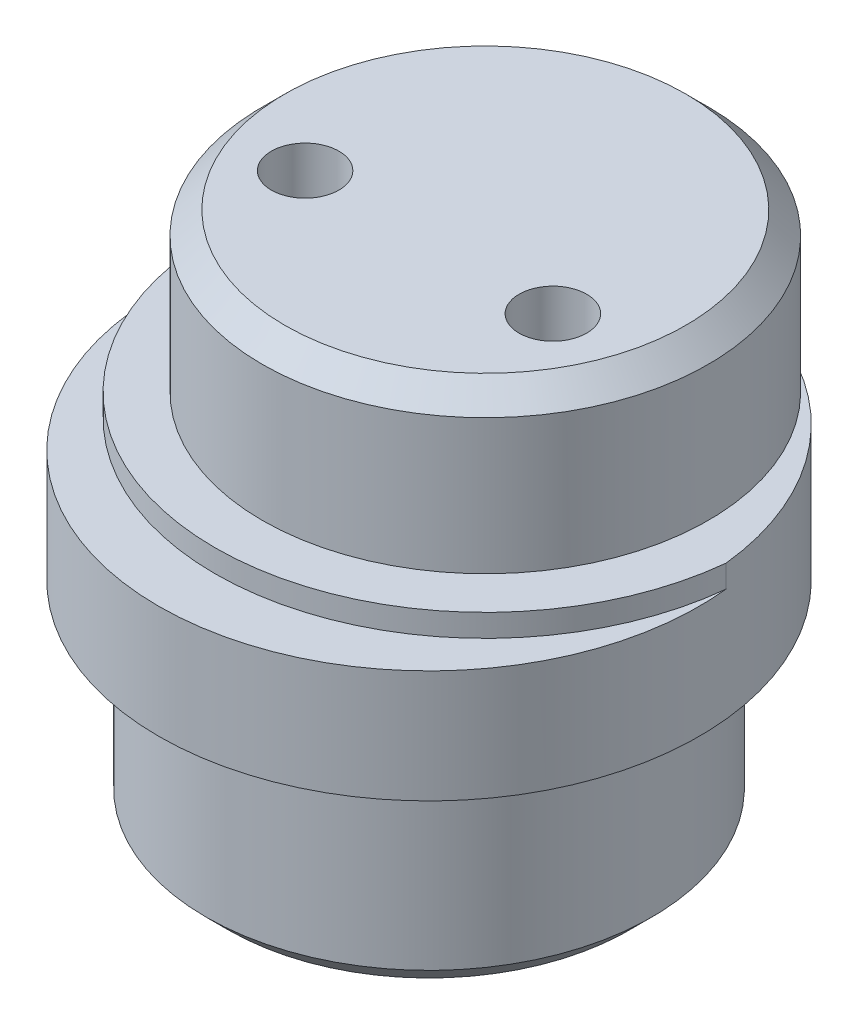
ISO-10303-21;
HEADER;
FILE_DESCRIPTION(('STEP AP214'),'2;1');
FILE_NAME('part.step','',(''),(''),'','','');
FILE_SCHEMA(('AUTOMOTIVE_DESIGN { 1 0 10303 214 1 1 1 1 }'));
ENDSEC;
DATA;
#1=APPLICATION_CONTEXT('core data for automotive mechanical design processes');
#2=APPLICATION_PROTOCOL_DEFINITION('international standard','automotive_design',2000,#1);
#3=PRODUCT_CONTEXT('',#1,'mechanical');
#4=PRODUCT('Part','Part','',(#3));
#5=PRODUCT_RELATED_PRODUCT_CATEGORY('part','',(#4));
#6=PRODUCT_DEFINITION_FORMATION('','',#4);
#7=PRODUCT_DEFINITION_CONTEXT('part definition',#1,'design');
#8=PRODUCT_DEFINITION('design','',#6,#7);
#9=PRODUCT_DEFINITION_SHAPE('','',#8);
#10=(LENGTH_UNIT() NAMED_UNIT(*) SI_UNIT(.MILLI.,.METRE.));
#11=(NAMED_UNIT(*) PLANE_ANGLE_UNIT() SI_UNIT($,.RADIAN.));
#12=(NAMED_UNIT(*) SI_UNIT($,.STERADIAN.) SOLID_ANGLE_UNIT());
#13=UNCERTAINTY_MEASURE_WITH_UNIT(LENGTH_MEASURE(1.E-05),#10,'distance_accuracy_value','');
#14=(GEOMETRIC_REPRESENTATION_CONTEXT(3) GLOBAL_UNCERTAINTY_ASSIGNED_CONTEXT((#13)) GLOBAL_UNIT_ASSIGNED_CONTEXT((#10,
#11,#12)) REPRESENTATION_CONTEXT('',''));
#15=CARTESIAN_POINT('',(0.,0.,0.));
#16=DIRECTION('',(0.,0.,1.));
#17=DIRECTION('',(1.,0.,0.));
#18=AXIS2_PLACEMENT_3D('',#15,#16,#17);
#19=CARTESIAN_POINT('',(0.,15.,0.));
#20=DIRECTION('',(0.,-1.,0.));
#21=DIRECTION('',(0.,0.,-1.));
#22=AXIS2_PLACEMENT_3D('',#19,#20,#21);
#23=CYLINDRICAL_SURFACE('',#22,12.);
#24=CARTESIAN_POINT('',(0.,9.,0.));
#25=DIRECTION('',(0.,1.,0.));
#26=DIRECTION('',(0.,0.,1.));
#27=AXIS2_PLACEMENT_3D('',#24,#25,#26);
#28=CIRCLE('',#27,12.);
#29=CARTESIAN_POINT('',(0.,9.,12.));
#30=VERTEX_POINT('',#29);
#31=EDGE_CURVE('E106',#30,#30,#28,.T.);
#32=ORIENTED_EDGE('',*,*,#31,.T.);
#33=EDGE_LOOP('',(#32));
#34=FACE_BOUND('',#33,.T.);
#35=DIRECTION('',(0.,1.,0.));
#36=VECTOR('',#35,1.);
#37=CARTESIAN_POINT('',(11.93471826228,14.5,-1.25));
#38=LINE('',#37,#36);
#39=CARTESIAN_POINT('',(11.93471826228,14.,-1.25));
#40=VERTEX_POINT('',#39);
#41=CARTESIAN_POINT('',(11.93471826228,15.,-1.25));
#42=VERTEX_POINT('',#41);
#43=EDGE_CURVE('E60',#40,#42,#38,.T.);
#44=ORIENTED_EDGE('',*,*,#43,.F.);
#45=CARTESIAN_POINT('',(0.,14.,0.));
#46=DIRECTION('',(0.,1.,0.));
#47=DIRECTION('',(0.,0.,1.));
#48=AXIS2_PLACEMENT_3D('',#45,#46,#47);
#49=CIRCLE('',#48,12.);
#50=CARTESIAN_POINT('',(-11.93471826228,14.,-1.25));
#51=VERTEX_POINT('',#50);
#52=EDGE_CURVE('E82',#51,#40,#49,.T.);
#53=ORIENTED_EDGE('',*,*,#52,.F.);
#54=DIRECTION('',(0.,1.,0.));
#55=VECTOR('',#54,1.);
#56=CARTESIAN_POINT('',(-11.93471826228,14.5,-1.25));
#57=LINE('',#56,#55);
#58=CARTESIAN_POINT('',(-11.93471826228,15.,-1.25));
#59=VERTEX_POINT('',#58);
#60=EDGE_CURVE('E92',#59,#51,#57,.F.);
#61=ORIENTED_EDGE('',*,*,#60,.F.);
#62=CARTESIAN_POINT('',(0.,15.,0.));
#63=DIRECTION('',(0.,1.,0.));
#64=DIRECTION('',(0.,0.,1.));
#65=AXIS2_PLACEMENT_3D('',#62,#63,#64);
#66=CIRCLE('',#65,12.);
#67=CARTESIAN_POINT('',(-5.90248218972323,15.,-10.448));
#68=VERTEX_POINT('',#67);
#69=EDGE_CURVE('E116',#68,#59,#66,.T.);
#70=ORIENTED_EDGE('',*,*,#69,.F.);
#71=CARTESIAN_POINT('',(5.90248218972323,15.,-10.448));
#72=VERTEX_POINT('',#71);
#73=EDGE_CURVE('E111',#72,#68,#66,.T.);
#74=ORIENTED_EDGE('',*,*,#73,.F.);
#75=EDGE_CURVE('E98',#42,#72,#66,.T.);
#76=ORIENTED_EDGE('',*,*,#75,.F.);
#77=EDGE_LOOP('',(#44,#53,#61,#70,#74,#76));
#78=FACE_BOUND('',#77,.T.);
#79=ADVANCED_FACE('F43',(#34,#78),#23,.T.);
#80=CARTESIAN_POINT('',(0.,15.,0.));
#81=DIRECTION('',(0.,1.,0.));
#82=DIRECTION('',(0.,0.,1.));
#83=AXIS2_PLACEMENT_3D('',#80,#81,#82);
#84=PLANE('',#83);
#85=ORIENTED_EDGE('',*,*,#69,.T.);
#86=CARTESIAN_POINT('',(0.,15.,-2.5));
#87=DIRECTION('',(0.,1.,0.));
#88=DIRECTION('',(0.,0.,1.));
#89=AXIS2_PLACEMENT_3D('',#86,#87,#88);
#90=CIRCLE('',#89,12.);
#91=EDGE_CURVE('E89',#59,#42,#90,.T.);
#92=ORIENTED_EDGE('',*,*,#91,.T.);
#93=ORIENTED_EDGE('',*,*,#75,.T.);
#94=CARTESIAN_POINT('',(0.,15.,-2.5));
#95=DIRECTION('',(0.,1.,0.));
#96=DIRECTION('',(0.,0.,1.));
#97=AXIS2_PLACEMENT_3D('',#94,#95,#96);
#98=CIRCLE('',#97,9.9);
#99=EDGE_CURVE('E68',#68,#72,#98,.T.);
#100=ORIENTED_EDGE('',*,*,#99,.F.);
#101=EDGE_LOOP('',(#85,#92,#93,#100));
#102=FACE_BOUND('',#101,.T.);
#103=ADVANCED_FACE('F147',(#102),#84,.T.);
#104=CARTESIAN_POINT('',(0.,9.,0.));
#105=DIRECTION('',(0.,-1.,0.));
#106=DIRECTION('',(0.,0.,-1.));
#107=AXIS2_PLACEMENT_3D('',#104,#105,#106);
#108=CYLINDRICAL_SURFACE('',#107,9.9);
#109=CARTESIAN_POINT('',(0.,0.999999999999997,0.));
#110=DIRECTION('',(0.,1.,0.));
#111=DIRECTION('',(0.,0.,1.));
#112=AXIS2_PLACEMENT_3D('',#109,#110,#111);
#113=CIRCLE('',#112,9.9);
#114=CARTESIAN_POINT('',(0.,0.999999999999997,9.9));
#115=VERTEX_POINT('',#114);
#116=EDGE_CURVE('E88',#115,#115,#113,.T.);
#117=ORIENTED_EDGE('',*,*,#116,.T.);
#118=EDGE_LOOP('',(#117));
#119=FACE_BOUND('',#118,.T.);
#120=CARTESIAN_POINT('',(0.,9.,0.));
#121=DIRECTION('',(0.,1.,0.));
#122=DIRECTION('',(0.,0.,1.));
#123=AXIS2_PLACEMENT_3D('',#120,#121,#122);
#124=CIRCLE('',#123,9.9);
#125=CARTESIAN_POINT('',(0.,9.,9.9));
#126=VERTEX_POINT('',#125);
#127=EDGE_CURVE('E115',#126,#126,#124,.T.);
#128=ORIENTED_EDGE('',*,*,#127,.F.);
#129=EDGE_LOOP('',(#128));
#130=FACE_BOUND('',#129,.T.);
#131=ADVANCED_FACE('F153',(#119,#130),#108,.T.);
#132=CARTESIAN_POINT('',(0.,0.,0.));
#133=DIRECTION('',(0.,1.,0.));
#134=DIRECTION('',(0.,0.,1.));
#135=AXIS2_PLACEMENT_3D('',#132,#133,#134);
#136=PLANE('',#135);
#137=CARTESIAN_POINT('',(0.,0.,0.));
#138=DIRECTION('',(0.,1.,0.));
#139=DIRECTION('',(0.,0.,1.));
#140=AXIS2_PLACEMENT_3D('',#137,#138,#139);
#141=CIRCLE('',#140,8.9);
#142=CARTESIAN_POINT('',(0.,0.,8.9));
#143=VERTEX_POINT('',#142);
#144=EDGE_CURVE('E127',#143,#143,#141,.F.);
#145=ORIENTED_EDGE('',*,*,#144,.T.);
#146=EDGE_LOOP('',(#145));
#147=FACE_BOUND('',#146,.T.);
#148=CARTESIAN_POINT('',(0.,0.,-5.5));
#149=DIRECTION('',(0.,-1.,0.));
#150=DIRECTION('',(0.,0.,-1.));
#151=AXIS2_PLACEMENT_3D('',#148,#149,#150);
#152=CIRCLE('',#151,1.5);
#153=CARTESIAN_POINT('',(0.,0.,-7.));
#154=VERTEX_POINT('',#153);
#155=EDGE_CURVE('E227',#154,#154,#152,.T.);
#156=ORIENTED_EDGE('',*,*,#155,.F.);
#157=EDGE_LOOP('',(#156));
#158=FACE_BOUND('',#157,.T.);
#159=CARTESIAN_POINT('',(0.,0.,5.5));
#160=DIRECTION('',(0.,-1.,0.));
#161=DIRECTION('',(0.,0.,-1.));
#162=AXIS2_PLACEMENT_3D('',#159,#160,#161);
#163=CIRCLE('',#162,1.5);
#164=CARTESIAN_POINT('',(0.,0.,4.));
#165=VERTEX_POINT('',#164);
#166=EDGE_CURVE('E236',#165,#165,#163,.T.);
#167=ORIENTED_EDGE('',*,*,#166,.F.);
#168=EDGE_LOOP('',(#167));
#169=FACE_BOUND('',#168,.T.);
#170=CARTESIAN_POINT('',(5.5,0.,0.));
#171=DIRECTION('',(0.,1.,0.));
#172=DIRECTION('',(0.,0.,1.));
#173=AXIS2_PLACEMENT_3D('',#170,#171,#172);
#174=CIRCLE('',#173,1.5);
#175=CARTESIAN_POINT('',(5.5,0.,1.5));
#176=VERTEX_POINT('',#175);
#177=EDGE_CURVE('E94',#176,#176,#174,.T.);
#178=ORIENTED_EDGE('',*,*,#177,.T.);
#179=EDGE_LOOP('',(#178));
#180=FACE_BOUND('',#179,.T.);
#181=CARTESIAN_POINT('',(-5.5,0.,0.));
#182=DIRECTION('',(0.,1.,0.));
#183=DIRECTION('',(0.,0.,1.));
#184=AXIS2_PLACEMENT_3D('',#181,#182,#183);
#185=CIRCLE('',#184,1.5);
#186=CARTESIAN_POINT('',(-5.5,0.,1.5));
#187=VERTEX_POINT('',#186);
#188=EDGE_CURVE('E226',#187,#187,#185,.T.);
#189=ORIENTED_EDGE('',*,*,#188,.T.);
#190=EDGE_LOOP('',(#189));
#191=FACE_BOUND('',#190,.T.);
#192=ADVANCED_FACE('F158',(#147,#158,#169,#180,#191),#136,.F.);
#193=CARTESIAN_POINT('',(0.,9.,0.));
#194=DIRECTION('',(0.,1.,0.));
#195=DIRECTION('',(0.,0.,1.));
#196=AXIS2_PLACEMENT_3D('',#193,#194,#195);
#197=PLANE('',#196);
#198=ORIENTED_EDGE('',*,*,#127,.T.);
#199=EDGE_LOOP('',(#198));
#200=FACE_BOUND('',#199,.T.);
#201=ORIENTED_EDGE('',*,*,#31,.F.);
#202=EDGE_LOOP('',(#201));
#203=FACE_BOUND('',#202,.T.);
#204=ADVANCED_FACE('F157',(#200,#203),#197,.F.);
#205=CARTESIAN_POINT('',(0.,15.,-2.5));
#206=DIRECTION('',(0.,1.,0.));
#207=DIRECTION('',(0.,0.,1.));
#208=AXIS2_PLACEMENT_3D('',#205,#206,#207);
#209=PLANE('',#208);
#210=EDGE_CURVE('E100',#72,#68,#98,.T.);
#211=ORIENTED_EDGE('',*,*,#210,.F.);
#212=ORIENTED_EDGE('',*,*,#73,.T.);
#213=EDGE_LOOP('',(#211,#212));
#214=FACE_BOUND('',#213,.T.);
#215=ADVANCED_FACE('F177',(#214),#209,.F.);
#216=CARTESIAN_POINT('',(0.,22.,-2.5));
#217=DIRECTION('',(0.,-1.,0.));
#218=DIRECTION('',(0.,0.,-1.));
#219=AXIS2_PLACEMENT_3D('',#216,#217,#218);
#220=CYLINDRICAL_SURFACE('',#219,9.9);
#221=CARTESIAN_POINT('',(0.,21.,-2.5));
#222=DIRECTION('',(0.,1.,0.));
#223=DIRECTION('',(0.,0.,1.));
#224=AXIS2_PLACEMENT_3D('',#221,#222,#223);
#225=CIRCLE('',#224,9.9);
#226=CARTESIAN_POINT('',(0.,21.,7.4));
#227=VERTEX_POINT('',#226);
#228=EDGE_CURVE('E11',#227,#227,#225,.F.);
#229=ORIENTED_EDGE('',*,*,#228,.T.);
#230=EDGE_LOOP('',(#229));
#231=FACE_BOUND('',#230,.T.);
#232=ORIENTED_EDGE('',*,*,#210,.T.);
#233=ORIENTED_EDGE('',*,*,#99,.T.);
#234=EDGE_LOOP('',(#232,#233));
#235=FACE_BOUND('',#234,.T.);
#236=ADVANCED_FACE('F182',(#231,#235),#220,.T.);
#237=CARTESIAN_POINT('',(0.,22.,-2.5));
#238=DIRECTION('',(0.,1.,0.));
#239=DIRECTION('',(0.,0.,1.));
#240=AXIS2_PLACEMENT_3D('',#237,#238,#239);
#241=PLANE('',#240);
#242=CARTESIAN_POINT('',(0.,22.,-2.5));
#243=DIRECTION('',(0.,1.,0.));
#244=DIRECTION('',(0.,0.,1.));
#245=AXIS2_PLACEMENT_3D('',#242,#243,#244);
#246=CIRCLE('',#245,8.90000000000001);
#247=CARTESIAN_POINT('',(0.,22.,6.4));
#248=VERTEX_POINT('',#247);
#249=EDGE_CURVE('E53',#248,#248,#246,.T.);
#250=ORIENTED_EDGE('',*,*,#249,.T.);
#251=EDGE_LOOP('',(#250));
#252=FACE_BOUND('',#251,.T.);
#253=CARTESIAN_POINT('',(5.5,22.,0.));
#254=DIRECTION('',(0.,1.,0.));
#255=DIRECTION('',(0.,0.,1.));
#256=AXIS2_PLACEMENT_3D('',#253,#254,#255);
#257=CIRCLE('',#256,1.5);
#258=CARTESIAN_POINT('',(5.5,22.,1.5));
#259=VERTEX_POINT('',#258);
#260=EDGE_CURVE('E248',#259,#259,#257,.T.);
#261=ORIENTED_EDGE('',*,*,#260,.F.);
#262=EDGE_LOOP('',(#261));
#263=FACE_BOUND('',#262,.T.);
#264=CARTESIAN_POINT('',(-5.5,22.,0.));
#265=DIRECTION('',(0.,1.,0.));
#266=DIRECTION('',(0.,0.,1.));
#267=AXIS2_PLACEMENT_3D('',#264,#265,#266);
#268=CIRCLE('',#267,1.5);
#269=CARTESIAN_POINT('',(-5.5,22.,1.5));
#270=VERTEX_POINT('',#269);
#271=EDGE_CURVE('E232',#270,#270,#268,.T.);
#272=ORIENTED_EDGE('',*,*,#271,.F.);
#273=EDGE_LOOP('',(#272));
#274=FACE_BOUND('',#273,.T.);
#275=ADVANCED_FACE('F134',(#252,#263,#274),#241,.T.);
#276=CARTESIAN_POINT('',(0.,14.,-2.5));
#277=DIRECTION('',(0.,1.,0.));
#278=DIRECTION('',(0.,0.,1.));
#279=AXIS2_PLACEMENT_3D('',#276,#277,#278);
#280=PLANE('',#279);
#281=ORIENTED_EDGE('',*,*,#52,.T.);
#282=CARTESIAN_POINT('',(0.,14.,-2.5));
#283=DIRECTION('',(0.,1.,0.));
#284=DIRECTION('',(0.,0.,1.));
#285=AXIS2_PLACEMENT_3D('',#282,#283,#284);
#286=CIRCLE('',#285,12.);
#287=EDGE_CURVE('E84',#51,#40,#286,.T.);
#288=ORIENTED_EDGE('',*,*,#287,.F.);
#289=EDGE_LOOP('',(#281,#288));
#290=FACE_BOUND('',#289,.T.);
#291=ADVANCED_FACE('F83',(#290),#280,.T.);
#292=CARTESIAN_POINT('',(0.,14.,-2.5));
#293=DIRECTION('',(0.,1.,0.));
#294=DIRECTION('',(0.,0.,1.));
#295=AXIS2_PLACEMENT_3D('',#292,#293,#294);
#296=CYLINDRICAL_SURFACE('',#295,12.);
#297=ORIENTED_EDGE('',*,*,#43,.T.);
#298=ORIENTED_EDGE('',*,*,#91,.F.);
#299=ORIENTED_EDGE('',*,*,#60,.T.);
#300=ORIENTED_EDGE('',*,*,#287,.T.);
#301=EDGE_LOOP('',(#297,#298,#299,#300));
#302=FACE_BOUND('',#301,.T.);
#303=ADVANCED_FACE('F91',(#302),#296,.T.);
#304=CARTESIAN_POINT('',(-5.5,0.,0.));
#305=DIRECTION('',(0.,1.,0.));
#306=DIRECTION('',(0.,0.,1.));
#307=AXIS2_PLACEMENT_3D('',#304,#305,#306);
#308=CYLINDRICAL_SURFACE('',#307,1.5);
#309=ORIENTED_EDGE('',*,*,#188,.F.);
#310=EDGE_LOOP('',(#309));
#311=FACE_BOUND('',#310,.T.);
#312=ORIENTED_EDGE('',*,*,#271,.T.);
#313=EDGE_LOOP('',(#312));
#314=FACE_BOUND('',#313,.T.);
#315=ADVANCED_FACE('F198',(#311,#314),#308,.F.);
#316=CARTESIAN_POINT('',(5.5,0.,0.));
#317=DIRECTION('',(0.,1.,0.));
#318=DIRECTION('',(0.,0.,1.));
#319=AXIS2_PLACEMENT_3D('',#316,#317,#318);
#320=CYLINDRICAL_SURFACE('',#319,1.5);
#321=ORIENTED_EDGE('',*,*,#177,.F.);
#322=EDGE_LOOP('',(#321));
#323=FACE_BOUND('',#322,.T.);
#324=ORIENTED_EDGE('',*,*,#260,.T.);
#325=EDGE_LOOP('',(#324));
#326=FACE_BOUND('',#325,.T.);
#327=ADVANCED_FACE('F201',(#323,#326),#320,.F.);
#328=CARTESIAN_POINT('',(0.,12.,5.5));
#329=DIRECTION('',(0.,-1.,0.));
#330=DIRECTION('',(0.,0.,-1.));
#331=AXIS2_PLACEMENT_3D('',#328,#329,#330);
#332=CYLINDRICAL_SURFACE('',#331,1.5);
#333=CARTESIAN_POINT('',(0.,12.,5.5));
#334=DIRECTION('',(0.,-1.,0.));
#335=DIRECTION('',(0.,0.,-1.));
#336=AXIS2_PLACEMENT_3D('',#333,#334,#335);
#337=CIRCLE('',#336,1.5);
#338=CARTESIAN_POINT('',(0.,12.,4.));
#339=VERTEX_POINT('',#338);
#340=EDGE_CURVE('E242',#339,#339,#337,.T.);
#341=ORIENTED_EDGE('',*,*,#340,.F.);
#342=EDGE_LOOP('',(#341));
#343=FACE_BOUND('',#342,.T.);
#344=ORIENTED_EDGE('',*,*,#166,.T.);
#345=EDGE_LOOP('',(#344));
#346=FACE_BOUND('',#345,.T.);
#347=ADVANCED_FACE('F205',(#343,#346),#332,.F.);
#348=CARTESIAN_POINT('',(0.,12.,5.5));
#349=DIRECTION('',(0.,-1.,0.));
#350=DIRECTION('',(0.,0.,-1.));
#351=AXIS2_PLACEMENT_3D('',#348,#349,#350);
#352=PLANE('',#351);
#353=ORIENTED_EDGE('',*,*,#340,.T.);
#354=EDGE_LOOP('',(#353));
#355=FACE_BOUND('',#354,.T.);
#356=ADVANCED_FACE('F207',(#355),#352,.T.);
#357=CARTESIAN_POINT('',(0.,12.,-5.5));
#358=DIRECTION('',(0.,-1.,0.));
#359=DIRECTION('',(0.,0.,-1.));
#360=AXIS2_PLACEMENT_3D('',#357,#358,#359);
#361=CYLINDRICAL_SURFACE('',#360,1.5);
#362=CARTESIAN_POINT('',(0.,12.,-5.5));
#363=DIRECTION('',(0.,-1.,0.));
#364=DIRECTION('',(0.,0.,-1.));
#365=AXIS2_PLACEMENT_3D('',#362,#363,#364);
#366=CIRCLE('',#365,1.5);
#367=CARTESIAN_POINT('',(0.,12.,-7.));
#368=VERTEX_POINT('',#367);
#369=EDGE_CURVE('E224',#368,#368,#366,.T.);
#370=ORIENTED_EDGE('',*,*,#369,.F.);
#371=EDGE_LOOP('',(#370));
#372=FACE_BOUND('',#371,.T.);
#373=ORIENTED_EDGE('',*,*,#155,.T.);
#374=EDGE_LOOP('',(#373));
#375=FACE_BOUND('',#374,.T.);
#376=ADVANCED_FACE('F210',(#372,#375),#361,.F.);
#377=CARTESIAN_POINT('',(0.,12.,-5.5));
#378=DIRECTION('',(0.,-1.,0.));
#379=DIRECTION('',(0.,0.,-1.));
#380=AXIS2_PLACEMENT_3D('',#377,#378,#379);
#381=PLANE('',#380);
#382=ORIENTED_EDGE('',*,*,#369,.T.);
#383=EDGE_LOOP('',(#382));
#384=FACE_BOUND('',#383,.T.);
#385=ADVANCED_FACE('F143',(#384),#381,.T.);
#386=CARTESIAN_POINT('',(0.,0.999999999999997,0.));
#387=DIRECTION('',(0.,1.,0.));
#388=DIRECTION('',(0.,0.,1.));
#389=AXIS2_PLACEMENT_3D('',#386,#387,#388);
#390=CONICAL_SURFACE('',#389,9.9,0.785398163397449);
#391=ORIENTED_EDGE('',*,*,#144,.F.);
#392=EDGE_LOOP('',(#391));
#393=FACE_BOUND('',#392,.T.);
#394=ORIENTED_EDGE('',*,*,#116,.F.);
#395=EDGE_LOOP('',(#394));
#396=FACE_BOUND('',#395,.T.);
#397=ADVANCED_FACE('F138',(#393,#396),#390,.T.);
#398=CARTESIAN_POINT('',(0.,22.,-2.5));
#399=DIRECTION('',(0.,-1.,0.));
#400=DIRECTION('',(0.,0.,-1.));
#401=AXIS2_PLACEMENT_3D('',#398,#399,#400);
#402=CONICAL_SURFACE('',#401,8.90000000000001,0.785398163397447);
#403=ORIENTED_EDGE('',*,*,#228,.F.);
#404=EDGE_LOOP('',(#403));
#405=FACE_BOUND('',#404,.T.);
#406=ORIENTED_EDGE('',*,*,#249,.F.);
#407=EDGE_LOOP('',(#406));
#408=FACE_BOUND('',#407,.T.);
#409=ADVANCED_FACE('F46',(#405,#408),#402,.T.);
#410=CLOSED_SHELL('',(#79,#103,#131,#192,#204,#215,#236,#275,#291,#303,#315,#327,#347,#356,#376,
#385,#397,#409));
#411=MANIFOLD_SOLID_BREP('B2',#410);
#412=ADVANCED_BREP_SHAPE_REPRESENTATION('',(#18,#411),#14);
#413=SHAPE_DEFINITION_REPRESENTATION(#9,#412);
ENDSEC;
END-ISO-10303-21;
